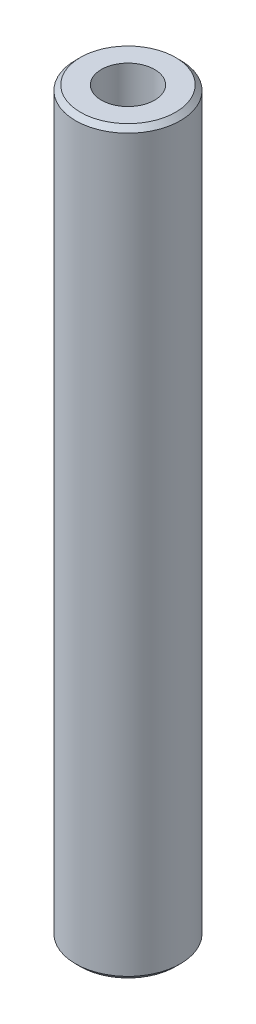
ISO-10303-21;
HEADER;
FILE_DESCRIPTION(('STEP AP214'),'2;1');
FILE_NAME('part.step','',(''),(''),'','','');
FILE_SCHEMA(('AUTOMOTIVE_DESIGN { 1 0 10303 214 1 1 1 1 }'));
ENDSEC;
DATA;
#1=APPLICATION_CONTEXT('core data for automotive mechanical design processes');
#2=APPLICATION_PROTOCOL_DEFINITION('international standard','automotive_design',2000,#1);
#3=PRODUCT_CONTEXT('',#1,'mechanical');
#4=PRODUCT('Part','Part','',(#3));
#5=PRODUCT_RELATED_PRODUCT_CATEGORY('part','',(#4));
#6=PRODUCT_DEFINITION_FORMATION('','',#4);
#7=PRODUCT_DEFINITION_CONTEXT('part definition',#1,'design');
#8=PRODUCT_DEFINITION('design','',#6,#7);
#9=PRODUCT_DEFINITION_SHAPE('','',#8);
#10=(LENGTH_UNIT() NAMED_UNIT(*) SI_UNIT(.MILLI.,.METRE.));
#11=(NAMED_UNIT(*) PLANE_ANGLE_UNIT() SI_UNIT($,.RADIAN.));
#12=(NAMED_UNIT(*) SI_UNIT($,.STERADIAN.) SOLID_ANGLE_UNIT());
#13=UNCERTAINTY_MEASURE_WITH_UNIT(LENGTH_MEASURE(1.E-05),#10,'distance_accuracy_value','');
#14=(GEOMETRIC_REPRESENTATION_CONTEXT(3) GLOBAL_UNCERTAINTY_ASSIGNED_CONTEXT((#13)) GLOBAL_UNIT_ASSIGNED_CONTEXT((#10,
#11,#12)) REPRESENTATION_CONTEXT('',''));
#15=CARTESIAN_POINT('',(0.,0.,0.));
#16=DIRECTION('',(0.,0.,1.));
#17=DIRECTION('',(1.,0.,0.));
#18=AXIS2_PLACEMENT_3D('',#15,#16,#17);
#19=CARTESIAN_POINT('',(0.,600.,0.));
#20=DIRECTION('',(0.,-1.,0.));
#21=DIRECTION('',(0.,0.,-1.));
#22=AXIS2_PLACEMENT_3D('',#19,#20,#21);
#23=CYLINDRICAL_SURFACE('',#22,42.5);
#24=CARTESIAN_POINT('',(0.,596.068235701435,0.));
#25=DIRECTION('',(0.,1.,0.));
#26=DIRECTION('',(0.,0.,1.));
#27=AXIS2_PLACEMENT_3D('',#24,#25,#26);
#28=CIRCLE('',#27,42.5);
#29=CARTESIAN_POINT('',(0.,596.068235701435,42.5));
#30=VERTEX_POINT('',#29);
#31=EDGE_CURVE('E50',#30,#30,#28,.F.);
#32=ORIENTED_EDGE('',*,*,#31,.T.);
#33=EDGE_LOOP('',(#32));
#34=FACE_BOUND('',#33,.T.);
#35=CARTESIAN_POINT('',(0.,3.93176429856434,0.));
#36=DIRECTION('',(0.,1.,0.));
#37=DIRECTION('',(0.,0.,1.));
#38=AXIS2_PLACEMENT_3D('',#35,#36,#37);
#39=CIRCLE('',#38,42.5);
#40=CARTESIAN_POINT('',(0.,3.93176429856434,42.5));
#41=VERTEX_POINT('',#40);
#42=EDGE_CURVE('E51',#41,#41,#39,.T.);
#43=ORIENTED_EDGE('',*,*,#42,.T.);
#44=EDGE_LOOP('',(#43));
#45=FACE_BOUND('',#44,.T.);
#46=ADVANCED_FACE('F39',(#34,#45),#23,.T.);
#47=CARTESIAN_POINT('',(0.,600.,0.));
#48=DIRECTION('',(0.,1.,0.));
#49=DIRECTION('',(0.,0.,1.));
#50=AXIS2_PLACEMENT_3D('',#47,#48,#49);
#51=PLANE('',#50);
#52=CARTESIAN_POINT('',(0.,600.,0.));
#53=DIRECTION('',(0.,1.,0.));
#54=DIRECTION('',(0.,0.,1.));
#55=AXIS2_PLACEMENT_3D('',#52,#53,#54);
#56=CIRCLE('',#55,38.5682357014355);
#57=CARTESIAN_POINT('',(0.,600.,38.5682357014355));
#58=VERTEX_POINT('',#57);
#59=EDGE_CURVE('E54',#58,#58,#56,.T.);
#60=ORIENTED_EDGE('',*,*,#59,.T.);
#61=EDGE_LOOP('',(#60));
#62=FACE_BOUND('',#61,.T.);
#63=CARTESIAN_POINT('',(0.,600.,0.));
#64=DIRECTION('',(0.,1.,0.));
#65=DIRECTION('',(0.,0.,1.));
#66=AXIS2_PLACEMENT_3D('',#63,#64,#65);
#67=CIRCLE('',#66,21.5970510634089);
#68=CARTESIAN_POINT('',(0.,600.,21.5970510634089));
#69=VERTEX_POINT('',#68);
#70=EDGE_CURVE('E58',#69,#69,#67,.T.);
#71=ORIENTED_EDGE('',*,*,#70,.F.);
#72=EDGE_LOOP('',(#71));
#73=FACE_BOUND('',#72,.T.);
#74=ADVANCED_FACE('F69',(#62,#73),#51,.T.);
#75=CARTESIAN_POINT('',(0.,0.,0.));
#76=DIRECTION('',(0.,1.,0.));
#77=DIRECTION('',(0.,0.,1.));
#78=AXIS2_PLACEMENT_3D('',#75,#76,#77);
#79=PLANE('',#78);
#80=CARTESIAN_POINT('',(0.,0.,0.));
#81=DIRECTION('',(0.,1.,0.));
#82=DIRECTION('',(0.,0.,1.));
#83=AXIS2_PLACEMENT_3D('',#80,#81,#82);
#84=CIRCLE('',#83,38.5682357014356);
#85=CARTESIAN_POINT('',(0.,0.,38.5682357014356));
#86=VERTEX_POINT('',#85);
#87=EDGE_CURVE('E10',#86,#86,#84,.F.);
#88=ORIENTED_EDGE('',*,*,#87,.T.);
#89=EDGE_LOOP('',(#88));
#90=FACE_BOUND('',#89,.T.);
#91=CARTESIAN_POINT('',(0.,0.,0.));
#92=DIRECTION('',(0.,1.,0.));
#93=DIRECTION('',(0.,0.,1.));
#94=AXIS2_PLACEMENT_3D('',#91,#92,#93);
#95=CIRCLE('',#94,21.5970510634089);
#96=CARTESIAN_POINT('',(0.,0.,21.5970510634089));
#97=VERTEX_POINT('',#96);
#98=EDGE_CURVE('E63',#97,#97,#95,.T.);
#99=ORIENTED_EDGE('',*,*,#98,.T.);
#100=EDGE_LOOP('',(#99));
#101=FACE_BOUND('',#100,.T.);
#102=ADVANCED_FACE('F75',(#90,#101),#79,.F.);
#103=CARTESIAN_POINT('',(0.,600.,0.));
#104=DIRECTION('',(0.,-1.,0.));
#105=DIRECTION('',(0.,0.,-1.));
#106=AXIS2_PLACEMENT_3D('',#103,#104,#105);
#107=CYLINDRICAL_SURFACE('',#106,21.5970510634089);
#108=ORIENTED_EDGE('',*,*,#70,.T.);
#109=EDGE_LOOP('',(#108));
#110=FACE_BOUND('',#109,.T.);
#111=ORIENTED_EDGE('',*,*,#98,.F.);
#112=EDGE_LOOP('',(#111));
#113=FACE_BOUND('',#112,.T.);
#114=ADVANCED_FACE('F70',(#110,#113),#107,.F.);
#115=CARTESIAN_POINT('',(0.,600.,0.));
#116=DIRECTION('',(0.,-1.,0.));
#117=DIRECTION('',(0.,0.,-1.));
#118=AXIS2_PLACEMENT_3D('',#115,#116,#117);
#119=CONICAL_SURFACE('',#118,38.5682357014355,0.785398163397438);
#120=ORIENTED_EDGE('',*,*,#31,.F.);
#121=EDGE_LOOP('',(#120));
#122=FACE_BOUND('',#121,.T.);
#123=ORIENTED_EDGE('',*,*,#59,.F.);
#124=EDGE_LOOP('',(#123));
#125=FACE_BOUND('',#124,.T.);
#126=ADVANCED_FACE('F81',(#122,#125),#119,.T.);
#127=CARTESIAN_POINT('',(0.,3.93176429856434,0.));
#128=DIRECTION('',(0.,1.,0.));
#129=DIRECTION('',(0.,0.,1.));
#130=AXIS2_PLACEMENT_3D('',#127,#128,#129);
#131=CONICAL_SURFACE('',#130,42.5,0.785398163397452);
#132=ORIENTED_EDGE('',*,*,#87,.F.);
#133=EDGE_LOOP('',(#132));
#134=FACE_BOUND('',#133,.T.);
#135=ORIENTED_EDGE('',*,*,#42,.F.);
#136=EDGE_LOOP('',(#135));
#137=FACE_BOUND('',#136,.T.);
#138=ADVANCED_FACE('F45',(#134,#137),#131,.T.);
#139=CLOSED_SHELL('',(#46,#74,#102,#114,#126,#138));
#140=MANIFOLD_SOLID_BREP('B2',#139);
#141=ADVANCED_BREP_SHAPE_REPRESENTATION('',(#18,#140),#14);
#142=SHAPE_DEFINITION_REPRESENTATION(#9,#141);
ENDSEC;
END-ISO-10303-21;
